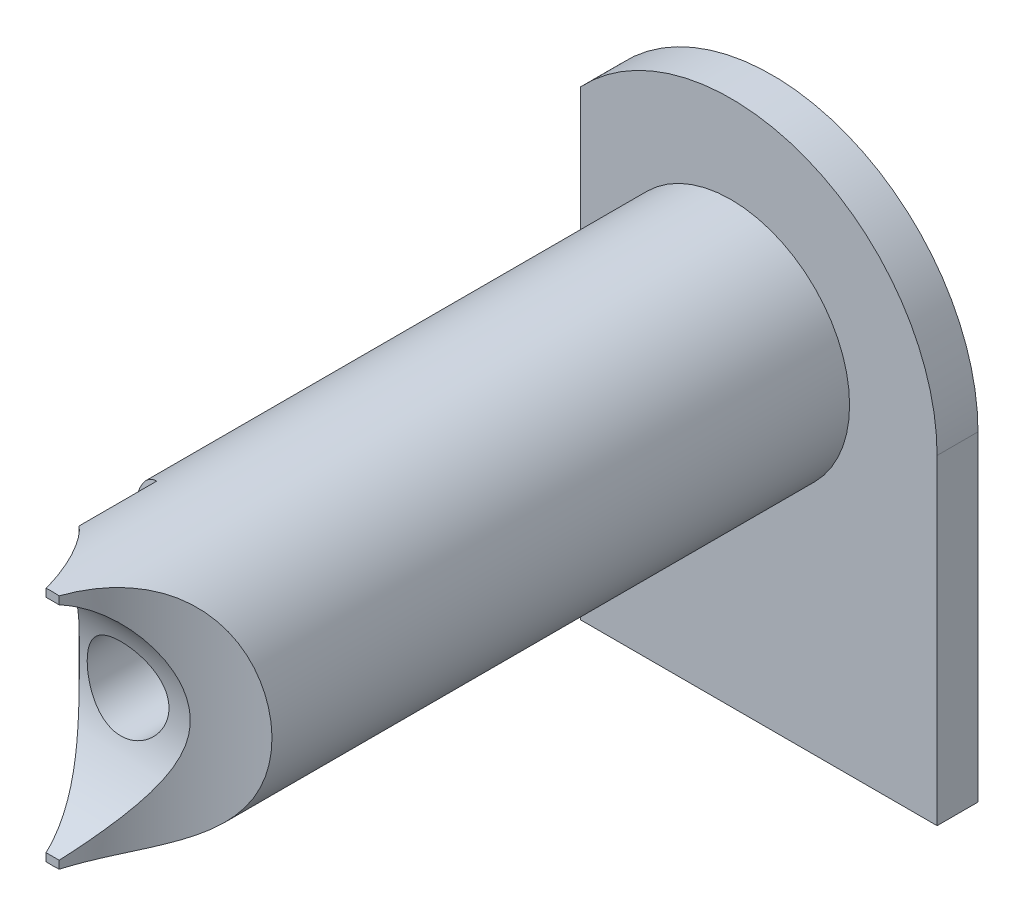
ISO-10303-21;
HEADER;
FILE_DESCRIPTION(('STEP AP214'),'2;1');
FILE_NAME('part.step','',(''),(''),'','','');
FILE_SCHEMA(('AUTOMOTIVE_DESIGN { 1 0 10303 214 1 1 1 1 }'));
ENDSEC;
DATA;
#1=APPLICATION_CONTEXT('core data for automotive mechanical design processes');
#2=APPLICATION_PROTOCOL_DEFINITION('international standard','automotive_design',2000,#1);
#3=PRODUCT_CONTEXT('',#1,'mechanical');
#4=PRODUCT('Part','Part','',(#3));
#5=PRODUCT_RELATED_PRODUCT_CATEGORY('part','',(#4));
#6=PRODUCT_DEFINITION_FORMATION('','',#4);
#7=PRODUCT_DEFINITION_CONTEXT('part definition',#1,'design');
#8=PRODUCT_DEFINITION('design','',#6,#7);
#9=PRODUCT_DEFINITION_SHAPE('','',#8);
#10=(LENGTH_UNIT() NAMED_UNIT(*) SI_UNIT(.MILLI.,.METRE.));
#11=(NAMED_UNIT(*) PLANE_ANGLE_UNIT() SI_UNIT($,.RADIAN.));
#12=(NAMED_UNIT(*) SI_UNIT($,.STERADIAN.) SOLID_ANGLE_UNIT());
#13=UNCERTAINTY_MEASURE_WITH_UNIT(LENGTH_MEASURE(1.E-05),#10,'distance_accuracy_value','');
#14=(GEOMETRIC_REPRESENTATION_CONTEXT(3) GLOBAL_UNCERTAINTY_ASSIGNED_CONTEXT((#13)) GLOBAL_UNIT_ASSIGNED_CONTEXT((#10,
#11,#12)) REPRESENTATION_CONTEXT('',''));
#15=CARTESIAN_POINT('',(0.,0.,0.));
#16=DIRECTION('',(0.,0.,1.));
#17=DIRECTION('',(1.,0.,0.));
#18=AXIS2_PLACEMENT_3D('',#15,#16,#17);
#19=CARTESIAN_POINT('',(0.,0.,0.));
#20=DIRECTION('',(0.,0.,1.));
#21=DIRECTION('',(1.,0.,0.));
#22=AXIS2_PLACEMENT_3D('',#19,#20,#21);
#23=CYLINDRICAL_SURFACE('',#22,2.2);
#24=CARTESIAN_POINT('',(0.,0.,1.39999999998963));
#25=DIRECTION('',(0.,0.,-1.));
#26=DIRECTION('',(1.,0.,0.));
#27=AXIS2_PLACEMENT_3D('',#24,#25,#26);
#28=CIRCLE('',#27,2.20000000001619);
#29=CARTESIAN_POINT('',(2.20000000001619,0.,1.39999999998963));
#30=VERTEX_POINT('',#29);
#31=EDGE_CURVE('E189',#30,#30,#28,.T.);
#32=ORIENTED_EDGE('',*,*,#31,.T.);
#33=EDGE_LOOP('',(#32));
#34=FACE_BOUND('',#33,.T.);
#35=CARTESIAN_POINT('',(0.,0.,16.));
#36=DIRECTION('',(0.,0.,1.));
#37=DIRECTION('',(1.,0.,0.));
#38=AXIS2_PLACEMENT_3D('',#35,#36,#37);
#39=CIRCLE('',#38,2.2);
#40=CARTESIAN_POINT('',(2.2,0.,16.));
#41=VERTEX_POINT('',#40);
#42=EDGE_CURVE('E19',#41,#41,#39,.T.);
#43=ORIENTED_EDGE('',*,*,#42,.T.);
#44=EDGE_LOOP('',(#43));
#45=FACE_BOUND('',#44,.T.);
#46=ADVANCED_FACE('F16',(#34,#45),#23,.F.);
#47=CARTESIAN_POINT('',(0.,0.,16.));
#48=DIRECTION('',(0.,0.,1.));
#49=DIRECTION('',(1.,0.,0.));
#50=AXIS2_PLACEMENT_3D('',#47,#48,#49);
#51=PLANE('',#50);
#52=CARTESIAN_POINT('',(0.,0.,16.));
#53=DIRECTION('',(0.,0.,-1.));
#54=DIRECTION('',(-1.,0.,0.));
#55=AXIS2_PLACEMENT_3D('',#52,#53,#54);
#56=CIRCLE('',#55,1.25);
#57=CARTESIAN_POINT('',(-1.25,0.,16.));
#58=VERTEX_POINT('',#57);
#59=EDGE_CURVE('E193',#58,#58,#56,.F.);
#60=ORIENTED_EDGE('',*,*,#59,.T.);
#61=EDGE_LOOP('',(#60));
#62=FACE_BOUND('',#61,.T.);
#63=ORIENTED_EDGE('',*,*,#42,.F.);
#64=EDGE_LOOP('',(#63));
#65=FACE_BOUND('',#64,.T.);
#66=ADVANCED_FACE('F291',(#62,#65),#51,.F.);
#67=CARTESIAN_POINT('',(0.,0.,0.));
#68=DIRECTION('',(0.,0.,-1.));
#69=DIRECTION('',(-1.,0.,0.));
#70=AXIS2_PLACEMENT_3D('',#67,#68,#69);
#71=CONICAL_SURFACE('',#70,3.60000000000582,0.785398163397448);
#72=CARTESIAN_POINT('',(0.,0.,0.));
#73=DIRECTION('',(0.,0.,-1.));
#74=DIRECTION('',(-1.,0.,0.));
#75=AXIS2_PLACEMENT_3D('',#72,#73,#74);
#76=CIRCLE('',#75,3.60000000000582);
#77=CARTESIAN_POINT('',(-3.60000000000582,0.,0.));
#78=VERTEX_POINT('',#77);
#79=EDGE_CURVE('E170',#78,#78,#76,.T.);
#80=ORIENTED_EDGE('',*,*,#79,.T.);
#81=EDGE_LOOP('',(#80));
#82=FACE_BOUND('',#81,.T.);
#83=ORIENTED_EDGE('',*,*,#31,.F.);
#84=EDGE_LOOP('',(#83));
#85=FACE_BOUND('',#84,.T.);
#86=ADVANCED_FACE('F288',(#82,#85),#71,.F.);
#87=CARTESIAN_POINT('',(0.,0.,22.));
#88=DIRECTION('',(0.,0.,-1.));
#89=DIRECTION('',(-1.,0.,0.));
#90=AXIS2_PLACEMENT_3D('',#87,#88,#89);
#91=CYLINDRICAL_SURFACE('',#90,1.25);
#92=ORIENTED_EDGE('',*,*,#59,.F.);
#93=EDGE_LOOP('',(#92));
#94=FACE_BOUND('',#93,.T.);
#95=CARTESIAN_POINT('',(0.,1.25,19.8978436713564));
#96=CARTESIAN_POINT('',(-0.0679244800988479,1.25000086796655,19.8978443860581));
#97=CARTESIAN_POINT('',(-0.135842933793422,1.24444487050265,19.8957833530326));
#98=CARTESIAN_POINT('',(-0.269657575517761,1.22244980443124,19.8878088146394));
#99=CARTESIAN_POINT('',(-0.335553550477822,1.20600959325332,19.881894904817));
#100=CARTESIAN_POINT('',(-0.463360945324166,1.16290062835713,19.8669627047752));
#101=CARTESIAN_POINT('',(-0.525280337329512,1.13625313605356,19.8579508713991));
#102=CARTESIAN_POINT('',(-0.643791152118634,1.07355949262704,19.837847899369));
#103=CARTESIAN_POINT('',(-0.700381263501824,1.03751103634852,19.8267562509232));
#104=CARTESIAN_POINT('',(-0.809007347203373,0.955414579593332,19.8032203151329));
#105=CARTESIAN_POINT('',(-0.860786737513333,0.909037171034703,19.7907405403483));
#106=CARTESIAN_POINT('',(-0.956009639956803,0.808301154152748,19.766133329688));
#107=CARTESIAN_POINT('',(-0.999451698829062,0.753941157312231,19.7540059555505));
#108=CARTESIAN_POINT('',(-1.07795080960379,0.636886846726681,19.7310560526318));
#109=CARTESIAN_POINT('',(-1.11273621101807,0.574000420441734,19.7202800833318));
#110=CARTESIAN_POINT('',(-1.17113157115788,0.442831894091509,19.701667612356));
#111=CARTESIAN_POINT('',(-1.19474477999888,0.374551369983123,19.6938302559428));
#112=CARTESIAN_POINT('',(-1.2292470985948,0.237225190263073,19.6822295733358));
#113=CARTESIAN_POINT('',(-1.24057636261075,0.16830221771519,19.678325699712));
#114=CARTESIAN_POINT('',(-1.25159174102537,0.0294302907076386,19.6745314082797));
#115=CARTESIAN_POINT('',(-1.25128107389356,-0.0405183747982762,19.6746398810475));
#116=CARTESIAN_POINT('',(-1.23929822635911,-0.176329706572923,19.6787644389511));
#117=CARTESIAN_POINT('',(-1.22810474950267,-0.242240442098288,19.6826158787156));
#118=CARTESIAN_POINT('',(-1.19546944676986,-0.371182833738493,19.6935843230476));
#119=CARTESIAN_POINT('',(-1.17402691447761,-0.434214291071031,19.7007015527082));
#120=CARTESIAN_POINT('',(-1.12123918718876,-0.556620898055839,19.7176047832685));
#121=CARTESIAN_POINT('',(-1.08976314845211,-0.61593458665218,19.7274257985207));
#122=CARTESIAN_POINT('',(-1.01791174395466,-0.728575193755699,19.7487221659081));
#123=CARTESIAN_POINT('',(-0.977533779711246,-0.781900357331002,19.760198000748));
#124=CARTESIAN_POINT('',(-0.886641267506775,-0.883891513879295,19.7842833845292));
#125=CARTESIAN_POINT('',(-0.8357188282652,-0.932187934326669,19.7969209237661));
#126=CARTESIAN_POINT('',(-0.726397770707999,-1.01968084494647,19.8214254442492));
#127=CARTESIAN_POINT('',(-0.66799781853852,-1.05887570804644,19.8332922874464));
#128=CARTESIAN_POINT('',(-0.544129319151011,-1.12761669610327,19.8550717885169));
#129=CARTESIAN_POINT('',(-0.478561028872439,-1.15699504567843,19.8649494215703));
#130=CARTESIAN_POINT('',(-0.342979508718129,-1.20416381175255,19.8812278361306));
#131=CARTESIAN_POINT('',(-0.272968324636218,-1.22195951975829,19.8876302050829));
#132=CARTESIAN_POINT('',(-0.134090244649073,-1.24468095728118,19.8958697798906));
#133=CARTESIAN_POINT('',(-0.065329920620134,-1.25018382842495,19.897911498419));
#134=CARTESIAN_POINT('',(0.0721472888909036,-1.24980687642328,19.8977724226291));
#135=CARTESIAN_POINT('',(0.140864180299875,-1.24392932217262,19.8955924699776));
#136=CARTESIAN_POINT('',(0.273588572060938,-1.22147843143933,19.8874606833778));
#137=CARTESIAN_POINT('',(0.337675880725648,-1.20531827758905,19.8816547123743));
#138=CARTESIAN_POINT('',(0.462212228709352,-1.16326336828004,19.8670890804522));
#139=CARTESIAN_POINT('',(0.522660591188891,-1.13736680831216,19.8583288720372));
#140=CARTESIAN_POINT('',(0.640446216933245,-1.07559215860392,19.838479568612));
#141=CARTESIAN_POINT('',(0.69761176173089,-1.03940914354079,19.8273223701759));
#142=CARTESIAN_POINT('',(0.80526753647923,-0.958428141299509,19.8040632405038));
#143=CARTESIAN_POINT('',(0.855755651824465,-0.913627436046384,19.7919610119165));
#144=CARTESIAN_POINT('',(0.951354636496911,-0.813903923966883,19.7674102209685));
#145=CARTESIAN_POINT('',(0.996046346298425,-0.758574360910484,19.7549766337844));
#146=CARTESIAN_POINT('',(1.07554433194323,-0.640894131740424,19.7317831377029));
#147=CARTESIAN_POINT('',(1.11035087446422,-0.578543655097271,19.7210231836585));
#148=CARTESIAN_POINT('',(1.16878954928363,-0.448840953661153,19.7024299594336));
#149=CARTESIAN_POINT('',(1.19248711414304,-0.381520791166974,19.6945796103623));
#150=CARTESIAN_POINT('',(1.22811609579468,-0.243523290194956,19.6826186057761));
#151=CARTESIAN_POINT('',(1.24005211170052,-0.172847275295524,19.6785064885507));
#152=CARTESIAN_POINT('',(1.25138151325684,-0.0339646408415084,19.6746036325415));
#153=CARTESIAN_POINT('',(1.25137467368776,0.0341877486817581,19.674606249536));
#154=CARTESIAN_POINT('',(1.24031579157669,0.169475270760439,19.6784153912838));
#155=CARTESIAN_POINT('',(1.22926475952144,0.236610495810688,19.6822215680309));
#156=CARTESIAN_POINT('',(1.19683703997043,0.366739710113705,19.6931287184379));
#157=CARTESIAN_POINT('',(1.17565097385536,0.429786678559307,19.7001687752202));
#158=CARTESIAN_POINT('',(1.12373438064327,0.551450801547351,19.7168175975318));
#159=CARTESIAN_POINT('',(1.09300209006457,0.610067135125508,19.7264268376227));
#160=CARTESIAN_POINT('',(1.02150459005946,0.72367495976101,19.7476932825457));
#161=CARTESIAN_POINT('',(0.980398025175527,0.7784393292172,19.7594152000636));
#162=CARTESIAN_POINT('',(0.889887080709123,0.880486113485907,19.7834460652259));
#163=CARTESIAN_POINT('',(0.840479956379136,0.92776604334017,19.7957552060804));
#164=CARTESIAN_POINT('',(0.732239723477382,1.01557160693506,19.8202070041386));
#165=CARTESIAN_POINT('',(0.673093154621859,1.05572043580642,19.8323198618095));
#166=CARTESIAN_POINT('',(0.548510903251562,1.1254910455994,19.8543727114239));
#167=CARTESIAN_POINT('',(0.483076273882375,1.15511458544152,19.8643130663155));
#168=CARTESIAN_POINT('',(0.349091955921276,1.20232010017759,19.8805798993618));
#169=CARTESIAN_POINT('',(0.280634096711385,1.22013735783424,19.8869765451443));
#170=CARTESIAN_POINT('',(0.141448006087147,1.24397438925929,19.8956071887561));
#171=CARTESIAN_POINT('',(0.0707207366450371,1.24999909630175,19.8978429272324));
#172=CARTESIAN_POINT('',(0.,1.25,19.8978436713564));
#173=B_SPLINE_CURVE_WITH_KNOTS('',3,(#95,#96,#97,#98,#99,#100,#101,#102,#103,#104,#105,#106,
#107,#108,#109,#110,#111,#112,#113,#114,#115,#116,#117,#118,#119,#120,#121,#122,#123,#124,#125,
#126,#127,#128,#129,#130,#131,#132,#133,#134,#135,#136,#137,#138,#139,#140,#141,#142,#143,#144,
#145,#146,#147,#148,#149,#150,#151,#152,#153,#154,#155,#156,#157,#158,#159,#160,#161,#162,#163,
#164,#165,#166,#167,#168,#169,#170,#171,#172),.UNSPECIFIED.,.T.,.F.,(4,2,2,2,2,2,2,2,2,2,2,2,2,
2,2,2,2,2,2,2,2,2,2,2,2,2,2,2,2,2,2,2,2,2,2,2,2,2,4),(0.,0.203511139491736,0.407043645954993,
0.610154486559866,0.813315177694251,1.02423741599598,1.23519638634716,1.45211698254992,
1.66897443527126,1.87777478156237,2.08651739447182,2.28647500077357,2.48644639113581,
2.68914025789089,2.89189336974925,3.1048510057456,3.31784668261728,3.53431589010938,
3.75068613453101,3.95666316344897,4.16259913132811,4.36074177300059,4.55892115580724,
4.7637300924964,4.96860373347955,5.18418899640245,5.3997684428082,5.61406164396909,
5.8282710168564,6.03172303865505,6.23515644734529,6.43490568970265,6.63469185386391,
6.84218649561138,7.04974988518443,7.26621834146235,7.4826506058514,7.69462841418539,
7.90651752514187),.UNSPECIFIED.);
#174=CARTESIAN_POINT('',(0.,1.25,19.8978436713564));
#175=VERTEX_POINT('',#174);
#176=EDGE_CURVE('E169',#175,#175,#173,.T.);
#177=ORIENTED_EDGE('',*,*,#176,.T.);
#178=EDGE_LOOP('',(#177));
#179=FACE_BOUND('',#178,.T.);
#180=ADVANCED_FACE('F284',(#94,#179),#91,.F.);
#181=CARTESIAN_POINT('',(0.,0.,0.));
#182=DIRECTION('',(0.,0.,1.));
#183=DIRECTION('',(1.,0.,0.));
#184=AXIS2_PLACEMENT_3D('',#181,#182,#183);
#185=PLANE('',#184);
#186=ORIENTED_EDGE('',*,*,#79,.F.);
#187=EDGE_LOOP('',(#186));
#188=FACE_BOUND('',#187,.T.);
#189=DIRECTION('',(0.,1.,0.));
#190=VECTOR('',#189,1.);
#191=CARTESIAN_POINT('',(6.3,-9.8,0.));
#192=LINE('',#191,#190);
#193=CARTESIAN_POINT('',(6.3,-9.8,0.));
#194=VERTEX_POINT('',#193);
#195=CARTESIAN_POINT('',(6.3,0.,0.));
#196=VERTEX_POINT('',#195);
#197=EDGE_CURVE('E110',#194,#196,#192,.T.);
#198=ORIENTED_EDGE('',*,*,#197,.F.);
#199=DIRECTION('',(1.,0.,0.));
#200=VECTOR('',#199,1.);
#201=CARTESIAN_POINT('',(-4.6,-9.8,0.));
#202=LINE('',#201,#200);
#203=CARTESIAN_POINT('',(-4.6,-9.8,0.));
#204=VERTEX_POINT('',#203);
#205=EDGE_CURVE('E127',#204,#194,#202,.T.);
#206=ORIENTED_EDGE('',*,*,#205,.F.);
#207=DIRECTION('',(0.,-1.,0.));
#208=VECTOR('',#207,1.);
#209=CARTESIAN_POINT('',(-4.6,4.30464865000618,0.));
#210=LINE('',#209,#208);
#211=CARTESIAN_POINT('',(-4.6,4.30464865000618,0.));
#212=VERTEX_POINT('',#211);
#213=EDGE_CURVE('E165',#212,#204,#210,.T.);
#214=ORIENTED_EDGE('',*,*,#213,.F.);
#215=CARTESIAN_POINT('',(0.,0.,0.));
#216=DIRECTION('',(0.,0.,1.));
#217=DIRECTION('',(1.,0.,0.));
#218=AXIS2_PLACEMENT_3D('',#215,#216,#217);
#219=CIRCLE('',#218,6.3);
#220=EDGE_CURVE('E103',#196,#212,#219,.T.);
#221=ORIENTED_EDGE('',*,*,#220,.F.);
#222=EDGE_LOOP('',(#198,#206,#214,#221));
#223=FACE_BOUND('',#222,.T.);
#224=ADVANCED_FACE('F272',(#188,#223),#185,.F.);
#225=CARTESIAN_POINT('',(0.,0.,23.2935034352874));
#226=DIRECTION('',(1.,0.,0.));
#227=DIRECTION('',(0.,0.,-1.));
#228=AXIS2_PLACEMENT_3D('',#225,#226,#227);
#229=CYLINDRICAL_SURFACE('',#228,3.61842579478704);
#230=ORIENTED_EDGE('',*,*,#176,.F.);
#231=EDGE_LOOP('',(#230));
#232=FACE_BOUND('',#231,.T.);
#233=DIRECTION('',(1.,0.,0.));
#234=VECTOR('',#233,1.);
#235=CARTESIAN_POINT('',(0.,3.37932746197818,22.));
#236=LINE('',#235,#234);
#237=CARTESIAN_POINT('',(-0.184638075837882,3.37932746197818,22.));
#238=VERTEX_POINT('',#237);
#239=CARTESIAN_POINT('',(0.218219539958672,3.37932746197818,22.));
#240=VERTEX_POINT('',#239);
#241=EDGE_CURVE('E171',#238,#240,#236,.T.);
#242=ORIENTED_EDGE('',*,*,#241,.F.);
#243=CARTESIAN_POINT('',(-0.184638075837882,3.37932746197818,22.));
#244=CARTESIAN_POINT('',(-0.211156231165822,3.34149870850248,21.9011564537886));
#245=CARTESIAN_POINT('',(-0.240102435210036,3.29956334294519,21.804599611213));
#246=CARTESIAN_POINT('',(-0.302028706600854,3.2081121569774,21.6166244880252));
#247=CARTESIAN_POINT('',(-0.335004563774821,3.15860423496916,21.5252009874701));
#248=CARTESIAN_POINT('',(-0.404101696405193,3.05275051746999,21.3481697718626));
#249=CARTESIAN_POINT('',(-0.440211237197433,2.99642994547444,21.2625423295464));
#250=CARTESIAN_POINT('',(-0.514855657187254,2.877318330208,21.0970419071478));
#251=CARTESIAN_POINT('',(-0.553391169868868,2.81452559413697,21.0171704418753));
#252=CARTESIAN_POINT('',(-0.671071326812881,2.61764283811563,20.7871974398669));
#253=CARTESIAN_POINT('',(-0.752632892515098,2.47453761652903,20.6458931668224));
#254=CARTESIAN_POINT('',(-0.91514122800787,2.16661334121827,20.3884801926924));
#255=CARTESIAN_POINT('',(-0.996087029222736,2.00176549151058,20.2724054551357));
#256=CARTESIAN_POINT('',(-1.13854217466289,1.67541983500405,20.0815381400047));
#257=CARTESIAN_POINT('',(-1.2012012753984,1.51645563765253,20.0032924300049));
#258=CARTESIAN_POINT('',(-1.31272831562854,1.18472090812666,19.8698730102282));
#259=CARTESIAN_POINT('',(-1.36162706865452,1.0119823531467,19.8146476153272));
#260=CARTESIAN_POINT('',(-1.43108421837339,0.688496535683084,19.7380477448507));
#261=CARTESIAN_POINT('',(-1.45520583678599,0.539567696935899,19.7123090323962));
#262=CARTESIAN_POINT('',(-1.48590572805914,0.237910065879286,19.6797308912269));
#263=CARTESIAN_POINT('',(-1.49250140019073,0.0851851943634162,19.6728727181946));
#264=CARTESIAN_POINT('',(-1.48711347849168,-0.219638538059778,19.6785316728409));
#265=CARTESIAN_POINT('',(-1.47511992170577,-0.371737019438807,19.6910591903351));
#266=CARTESIAN_POINT('',(-1.43442357218647,-0.67100977546266,19.7346139908888));
#267=CARTESIAN_POINT('',(-1.4056997864648,-0.81817761737474,19.7656645176927));
#268=CARTESIAN_POINT('',(-1.32503908738958,-1.14628720981243,19.8560875352559));
#269=CARTESIAN_POINT('',(-1.26877988168136,-1.32459779253885,19.9210717458046));
#270=CARTESIAN_POINT('',(-1.14340801119706,-1.66541071910351,20.075649049543));
#271=CARTESIAN_POINT('',(-1.07426888421057,-1.82787944915997,20.1652929910027));
#272=CARTESIAN_POINT('',(-0.929036379858701,-2.13918185944321,20.3690728991352));
#273=CARTESIAN_POINT('',(-0.852820661460019,-2.28762171998165,20.4837192110942));
#274=CARTESIAN_POINT('',(-0.701382057343645,-2.5651243495847,20.7345935165106));
#275=CARTESIAN_POINT('',(-0.626157563676736,-2.69422331116887,20.8707801939833));
#276=CARTESIAN_POINT('',(-0.518621597069257,-2.87119991529148,21.0894426414053));
#277=CARTESIAN_POINT('',(-0.483831102446247,-2.92715907171335,21.1642913146299));
#278=CARTESIAN_POINT('',(-0.416464846072824,-3.03352434479586,21.3187815726451));
#279=CARTESIAN_POINT('',(-0.383888590896951,-3.08393170019425,21.3984220821068));
#280=CARTESIAN_POINT('',(-0.321456204380259,-3.17898141683488,21.5625759173482));
#281=CARTESIAN_POINT('',(-0.291611547947464,-3.2235997601302,21.6471075640776));
#282=CARTESIAN_POINT('',(-0.235373748885312,-3.30641251909317,21.82045054339));
#283=CARTESIAN_POINT('',(-0.208983543288508,-3.34460147618006,21.9092654309972));
#284=CARTESIAN_POINT('',(-0.184638075837881,-3.37932746197819,22.));
#285=B_SPLINE_CURVE_WITH_KNOTS('',3,(#243,#244,#245,#246,#247,#248,#249,#250,#251,#252,#253,
#254,#255,#256,#257,#258,#259,#260,#261,#262,#263,#264,#265,#266,#267,#268,#269,#270,#271,#272,
#273,#274,#275,#276,#277,#278,#279,#280,#281,#282,#283,#284),.UNSPECIFIED.,.F.,.F.,(4,2,2,2,2,2,
2,2,2,2,2,2,2,2,2,2,2,2,2,2,4),(0.,0.327108060363067,0.653877234984881,0.979471606352299,
1.3051513543538,1.95341331613028,2.60254262412977,3.16433156329025,3.72485229241627,
4.182013982662,4.63872164565754,5.09567416720481,5.55320130900164,6.14384287358508,
6.73571158795343,7.34103221298297,7.94520556295312,8.24412659479571,8.54298079460886,
8.84303774768608,9.14334817979042),.UNSPECIFIED.);
#286=CARTESIAN_POINT('',(-0.184638075837881,-3.37932746197818,22.));
#287=VERTEX_POINT('',#286);
#288=EDGE_CURVE('E175',#238,#287,#285,.T.);
#289=ORIENTED_EDGE('',*,*,#288,.T.);
#290=DIRECTION('',(1.,0.,0.));
#291=VECTOR('',#290,1.);
#292=CARTESIAN_POINT('',(0.,-3.37932746197818,22.));
#293=LINE('',#292,#291);
#294=CARTESIAN_POINT('',(0.218219539958672,-3.37932746197818,22.));
#295=VERTEX_POINT('',#294);
#296=EDGE_CURVE('E166',#295,#287,#293,.F.);
#297=ORIENTED_EDGE('',*,*,#296,.F.);
#298=CARTESIAN_POINT('',(0.218219539958672,-3.37932746197818,22.));
#299=CARTESIAN_POINT('',(0.249955595366505,-3.34129490718428,21.9006260992964));
#300=CARTESIAN_POINT('',(0.284622608844999,-3.29921371335805,21.8038249336452));
#301=CARTESIAN_POINT('',(0.358874569765495,-3.20773227207749,21.6158999905739));
#302=CARTESIAN_POINT('',(0.398452521957451,-3.15834241634905,21.5247684090622));
#303=CARTESIAN_POINT('',(0.481412109280792,-3.05324603464561,21.3489932261304));
#304=CARTESIAN_POINT('',(0.524767948097167,-2.99758168690944,21.2643120424699));
#305=CARTESIAN_POINT('',(0.614630027769926,-2.88026548643591,21.1009731962136));
#306=CARTESIAN_POINT('',(0.661137389969564,-2.81861149910588,21.0223176990502));
#307=CARTESIAN_POINT('',(0.803537182970882,-2.62617949665099,20.7964695843413));
#308=CARTESIAN_POINT('',(0.902861324595828,-2.4872440652626,20.6582654552818));
#309=CARTESIAN_POINT('',(1.10382943480736,-2.18967908156275,20.4062047350761));
#310=CARTESIAN_POINT('',(1.20547857075844,-2.03100128134004,20.2924097196792));
#311=CARTESIAN_POINT('',(1.38744824926844,-1.71969183503718,20.1054786092747));
#312=CARTESIAN_POINT('',(1.46868125810829,-1.56972223376261,20.0288042654267));
#313=CARTESIAN_POINT('',(1.61859507468528,-1.25534052987597,19.8955423392714));
#314=CARTESIAN_POINT('',(1.68730843145521,-1.09096757227611,19.8389022990206));
#315=CARTESIAN_POINT('',(1.78407116856308,-0.799205821324052,19.7622552275132));
#316=CARTESIAN_POINT('',(1.81813629235307,-0.675412440235208,19.7363604986931));
#317=CARTESIAN_POINT('',(1.8699638889713,-0.422557817866898,19.69757133253));
#318=CARTESIAN_POINT('',(1.88776080128269,-0.293508311929657,19.6846494262472));
#319=CARTESIAN_POINT('',(1.9039713158961,-0.0327035544222784,19.6728618199396));
#320=CARTESIAN_POINT('',(1.90226877130446,0.0990632387624701,19.6740803467978));
#321=CARTESIAN_POINT('',(1.87953775332483,0.360062829307596,19.6906537282976));
#322=CARTESIAN_POINT('',(1.85848336601226,0.489291991489006,19.7060275382334));
#323=CARTESIAN_POINT('',(1.79340159777166,0.773832864086648,19.7551384332685));
#324=CARTESIAN_POINT('',(1.74490124501591,0.927444496541583,19.7925446470255));
#325=CARTESIAN_POINT('',(1.63224816655548,1.22347710666229,19.8846461611147));
#326=CARTESIAN_POINT('',(1.56804631713182,1.3658610718166,19.9393958842611));
#327=CARTESIAN_POINT('',(1.44859049514985,1.60457570668872,20.0483690565294));
#328=CARTESIAN_POINT('',(1.39519091495397,1.70343437789258,20.0992111252219));
#329=CARTESIAN_POINT('',(1.28581693924228,1.89508020958081,20.209044778376));
#330=CARTESIAN_POINT('',(1.22984131203267,1.98786441320282,20.2680402888479));
#331=CARTESIAN_POINT('',(1.11706053040588,2.16741089926434,20.3939595772521));
#332=CARTESIAN_POINT('',(1.06025509651569,2.25417109349274,20.4608860829024));
#333=CARTESIAN_POINT('',(0.947277450181522,2.42150527115037,20.6025285263854));
#334=CARTESIAN_POINT('',(0.891105375481016,2.50207793023455,20.6772461237552));
#335=CARTESIAN_POINT('',(0.738883420718191,2.71528114483798,20.8939750580893));
#336=CARTESIAN_POINT('',(0.644761687038023,2.84126157853707,21.0441856505552));
#337=CARTESIAN_POINT('',(0.513224865558886,3.01244722593785,21.2865363692757));
#338=CARTESIAN_POINT('',(0.471037092150247,3.06648426251062,21.3700355919397));
#339=CARTESIAN_POINT('',(0.390589747786621,3.16818347863871,21.5426088703919));
#340=CARTESIAN_POINT('',(0.352327503413965,3.21585000351376,21.6316790647196));
#341=CARTESIAN_POINT('',(0.298874623312115,3.28162373663356,21.7682373781404));
#342=CARTESIAN_POINT('',(0.281872812231806,3.30240414888444,21.8137549004021));
#343=CARTESIAN_POINT('',(0.249100289691648,3.34220484205815,21.9059898113939));
#344=CARTESIAN_POINT('',(0.233329651090148,3.36122501882607,21.9527072709168));
#345=CARTESIAN_POINT('',(0.218219539958636,3.37932746197831,21.9999999999999));
#346=B_SPLINE_CURVE_WITH_KNOTS('',3,(#298,#299,#300,#301,#302,#303,#304,#305,#306,#307,#308,
#309,#310,#311,#312,#313,#314,#315,#316,#317,#318,#319,#320,#321,#322,#323,#324,#325,#326,#327,
#328,#329,#330,#331,#332,#333,#334,#335,#336,#337,#338,#339,#340,#341,#342,#343,#344,#345),
.UNSPECIFIED.,.F.,.F.,(4,2,2,2,2,2,2,2,2,2,2,2,2,2,2,2,2,2,2,2,2,2,2,4),(0.,0.332850360488146,
0.665231930102698,0.995499245862366,1.32588469737193,1.98240202844311,2.64055653949701,
3.20000818888788,3.75798392959356,4.14950264865803,4.54019059773311,4.93320685141966,
5.32675015852905,5.82013096474709,6.31507556536427,6.6846162396128,7.0543354775105,
7.42418224452947,7.79410795210199,8.44346251961739,8.76727141479949,9.09085830055256,
9.24934826830561,9.4078476080825),.UNSPECIFIED.);
#347=EDGE_CURVE('E260',#295,#240,#346,.T.);
#348=ORIENTED_EDGE('',*,*,#347,.T.);
#349=EDGE_LOOP('',(#242,#289,#297,#348));
#350=FACE_BOUND('',#349,.T.);
#351=ADVANCED_FACE('F266',(#232,#350),#229,.F.);
#352=CARTESIAN_POINT('',(0.,0.,0.));
#353=DIRECTION('',(0.,0.,1.));
#354=DIRECTION('',(1.,0.,0.));
#355=AXIS2_PLACEMENT_3D('',#352,#353,#354);
#356=CYLINDRICAL_SURFACE('',#355,6.3);
#357=CARTESIAN_POINT('',(0.,0.,1.25));
#358=DIRECTION('',(0.,0.,1.));
#359=DIRECTION('',(1.,0.,0.));
#360=AXIS2_PLACEMENT_3D('',#357,#358,#359);
#361=CIRCLE('',#360,6.3);
#362=CARTESIAN_POINT('',(6.3,0.,1.25));
#363=VERTEX_POINT('',#362);
#364=CARTESIAN_POINT('',(-4.6,4.30464865000618,1.25));
#365=VERTEX_POINT('',#364);
#366=EDGE_CURVE('E149',#363,#365,#361,.T.);
#367=ORIENTED_EDGE('',*,*,#366,.F.);
#368=DIRECTION('',(0.,0.,1.));
#369=VECTOR('',#368,1.);
#370=CARTESIAN_POINT('',(6.3,0.,0.));
#371=LINE('',#370,#369);
#372=EDGE_CURVE('E131',#196,#363,#371,.T.);
#373=ORIENTED_EDGE('',*,*,#372,.F.);
#374=ORIENTED_EDGE('',*,*,#220,.T.);
#375=DIRECTION('',(0.,0.,1.));
#376=VECTOR('',#375,1.);
#377=CARTESIAN_POINT('',(-4.6,4.30464865000618,0.));
#378=LINE('',#377,#376);
#379=EDGE_CURVE('E161',#365,#212,#378,.F.);
#380=ORIENTED_EDGE('',*,*,#379,.F.);
#381=EDGE_LOOP('',(#367,#373,#374,#380));
#382=FACE_BOUND('',#381,.T.);
#383=ADVANCED_FACE('F271',(#382),#356,.T.);
#384=CARTESIAN_POINT('',(-4.6,4.30464865000618,0.));
#385=DIRECTION('',(-1.,0.,0.));
#386=DIRECTION('',(0.,-1.,0.));
#387=AXIS2_PLACEMENT_3D('',#384,#385,#386);
#388=PLANE('',#387);
#389=DIRECTION('',(0.,1.,0.));
#390=VECTOR('',#389,1.);
#391=CARTESIAN_POINT('',(-4.6,-3.08264576191558,1.25));
#392=LINE('',#391,#390);
#393=CARTESIAN_POINT('',(-4.6,-9.8,1.25));
#394=VERTEX_POINT('',#393);
#395=EDGE_CURVE('E144',#365,#394,#392,.F.);
#396=ORIENTED_EDGE('',*,*,#395,.F.);
#397=ORIENTED_EDGE('',*,*,#379,.T.);
#398=ORIENTED_EDGE('',*,*,#213,.T.);
#399=DIRECTION('',(0.,0.,1.));
#400=VECTOR('',#399,1.);
#401=CARTESIAN_POINT('',(-4.6,-9.8,0.));
#402=LINE('',#401,#400);
#403=EDGE_CURVE('E156',#394,#204,#402,.F.);
#404=ORIENTED_EDGE('',*,*,#403,.F.);
#405=EDGE_LOOP('',(#396,#397,#398,#404));
#406=FACE_BOUND('',#405,.T.);
#407=ADVANCED_FACE('F375',(#406),#388,.T.);
#408=CARTESIAN_POINT('',(-4.6,-9.8,0.));
#409=DIRECTION('',(0.,-1.,0.));
#410=DIRECTION('',(1.,0.,0.));
#411=AXIS2_PLACEMENT_3D('',#408,#409,#410);
#412=PLANE('',#411);
#413=DIRECTION('',(1.,0.,0.));
#414=VECTOR('',#413,1.);
#415=CARTESIAN_POINT('',(0.574107153339075,-9.8,1.25));
#416=LINE('',#415,#414);
#417=CARTESIAN_POINT('',(6.3,-9.8,1.25));
#418=VERTEX_POINT('',#417);
#419=EDGE_CURVE('E125',#394,#418,#416,.T.);
#420=ORIENTED_EDGE('',*,*,#419,.F.);
#421=ORIENTED_EDGE('',*,*,#403,.T.);
#422=ORIENTED_EDGE('',*,*,#205,.T.);
#423=DIRECTION('',(0.,0.,1.));
#424=VECTOR('',#423,1.);
#425=CARTESIAN_POINT('',(6.3,-9.8,0.));
#426=LINE('',#425,#424);
#427=EDGE_CURVE('E120',#418,#194,#426,.F.);
#428=ORIENTED_EDGE('',*,*,#427,.F.);
#429=EDGE_LOOP('',(#420,#421,#422,#428));
#430=FACE_BOUND('',#429,.T.);
#431=ADVANCED_FACE('F122',(#430),#412,.T.);
#432=CARTESIAN_POINT('',(6.3,-9.8,0.));
#433=DIRECTION('',(1.,0.,0.));
#434=DIRECTION('',(0.,1.,0.));
#435=AXIS2_PLACEMENT_3D('',#432,#433,#434);
#436=PLANE('',#435);
#437=DIRECTION('',(0.,1.,0.));
#438=VECTOR('',#437,1.);
#439=CARTESIAN_POINT('',(6.3,-3.08264576191558,1.25));
#440=LINE('',#439,#438);
#441=EDGE_CURVE('E135',#418,#363,#440,.T.);
#442=ORIENTED_EDGE('',*,*,#441,.F.);
#443=ORIENTED_EDGE('',*,*,#427,.T.);
#444=ORIENTED_EDGE('',*,*,#197,.T.);
#445=ORIENTED_EDGE('',*,*,#372,.T.);
#446=EDGE_LOOP('',(#442,#443,#444,#445));
#447=FACE_BOUND('',#446,.T.);
#448=ADVANCED_FACE('F136',(#447),#436,.T.);
#449=CARTESIAN_POINT('',(-1.8,0.,17.));
#450=DIRECTION('',(0.5,0.,-0.866025403784439));
#451=DIRECTION('',(-0.866025403784439,0.,-0.5));
#452=AXIS2_PLACEMENT_3D('',#449,#450,#451);
#453=PLANE('',#452);
#454=DIRECTION('',(0.,1.,0.));
#455=VECTOR('',#454,1.);
#456=CARTESIAN_POINT('',(-1.8,0.,17.));
#457=LINE('',#456,#455);
#458=CARTESIAN_POINT('',(-1.8,-3.14652586196268,17.));
#459=VERTEX_POINT('',#458);
#460=CARTESIAN_POINT('',(-1.8,3.14652586196268,17.));
#461=VERTEX_POINT('',#460);
#462=EDGE_CURVE('E130',#459,#461,#457,.T.);
#463=ORIENTED_EDGE('',*,*,#462,.T.);
#464=CARTESIAN_POINT('',(0.,0.,18.0392304845413));
#465=DIRECTION('',(0.5,0.,-0.866025403784439));
#466=DIRECTION('',(0.866025403784439,0.,0.5));
#467=AXIS2_PLACEMENT_3D('',#464,#465,#466);
#468=ELLIPSE('',#467,4.18578945162479,3.625);
#469=EDGE_CURVE('E238',#459,#461,#468,.T.);
#470=ORIENTED_EDGE('',*,*,#469,.F.);
#471=EDGE_LOOP('',(#463,#470));
#472=FACE_BOUND('',#471,.T.);
#473=ADVANCED_FACE('F366',(#472),#453,.F.);
#474=CARTESIAN_POINT('',(-1.8,0.,22.));
#475=DIRECTION('',(1.,0.,0.));
#476=DIRECTION('',(0.,0.,-1.));
#477=AXIS2_PLACEMENT_3D('',#474,#475,#476);
#478=PLANE('',#477);
#479=DIRECTION('',(0.,0.,1.));
#480=VECTOR('',#479,1.);
#481=CARTESIAN_POINT('',(-1.8,3.14652586196268,0.));
#482=LINE('',#481,#480);
#483=CARTESIAN_POINT('',(-1.79999999999999,3.14652586196269,19.3750776405004));
#484=VERTEX_POINT('',#483);
#485=EDGE_CURVE('E328',#461,#484,#482,.T.);
#486=ORIENTED_EDGE('',*,*,#485,.F.);
#487=ORIENTED_EDGE('',*,*,#462,.F.);
#488=DIRECTION('',(0.,0.,1.));
#489=VECTOR('',#488,1.);
#490=CARTESIAN_POINT('',(-1.8,-3.14652586196268,0.));
#491=LINE('',#490,#489);
#492=CARTESIAN_POINT('',(-1.8,-3.14652586196268,19.3750776405004));
#493=VERTEX_POINT('',#492);
#494=EDGE_CURVE('E237',#493,#459,#491,.F.);
#495=ORIENTED_EDGE('',*,*,#494,.F.);
#496=DIRECTION('',(0.,1.,0.));
#497=VECTOR('',#496,1.);
#498=CARTESIAN_POINT('',(-1.79999999999999,0.,19.3750776405004));
#499=LINE('',#498,#497);
#500=EDGE_CURVE('E259',#493,#484,#499,.T.);
#501=ORIENTED_EDGE('',*,*,#500,.T.);
#502=EDGE_LOOP('',(#486,#487,#495,#501));
#503=FACE_BOUND('',#502,.T.);
#504=ADVANCED_FACE('F245',(#503),#478,.F.);
#505=CARTESIAN_POINT('',(-5.4,0.,23.4));
#506=DIRECTION('',(0.,1.,0.));
#507=DIRECTION('',(0.,0.,1.));
#508=AXIS2_PLACEMENT_3D('',#505,#506,#507);
#509=CYLINDRICAL_SURFACE('',#508,5.4);
#510=DIRECTION('',(0.,1.,0.));
#511=VECTOR('',#510,1.);
#512=CARTESIAN_POINT('',(-0.184638075837881,0.,22.));
#513=LINE('',#512,#511);
#514=CARTESIAN_POINT('',(-0.184638075837881,3.62029470912948,22.));
#515=VERTEX_POINT('',#514);
#516=EDGE_CURVE('E174',#515,#238,#513,.F.);
#517=ORIENTED_EDGE('',*,*,#516,.F.);
#518=CARTESIAN_POINT('',(-1.79999999999999,3.14652586196269,19.3750776405004));
#519=CARTESIAN_POINT('',(-1.71977721871926,3.19242463934373,19.4467729888297));
#520=CARTESIAN_POINT('',(-1.64036903943807,3.23377401589615,19.5221673969035));
#521=CARTESIAN_POINT('',(-1.48454971683947,3.30819685108098,19.6796006841654));
#522=CARTESIAN_POINT('',(-1.40813441050172,3.34128217650513,19.7616298093544));
#523=CARTESIAN_POINT('',(-1.25990098807927,3.39994080184454,19.931250397919));
#524=CARTESIAN_POINT('',(-1.18805680222206,3.42556038862744,20.0188033076942));
#525=CARTESIAN_POINT('',(-1.04931897795177,3.47057255990351,20.1992922210633));
#526=CARTESIAN_POINT('',(-0.98242688432158,3.48996320755339,20.2922298884256));
#527=CARTESIAN_POINT('',(-0.8546555516464,3.52342600211264,20.4823150131274));
#528=CARTESIAN_POINT('',(-0.793745926306146,3.53752617552029,20.5794371580583));
#529=CARTESIAN_POINT('',(-0.678022567689542,3.56151583691171,20.7777605312194));
#530=CARTESIAN_POINT('',(-0.623211483306292,3.57140350043168,20.8789635061526));
#531=CARTESIAN_POINT('',(-0.468513246336572,3.59612305268534,21.1879067885231));
#532=CARTESIAN_POINT('',(-0.378308769641544,3.60602353140226,21.4010591801451));
#533=CARTESIAN_POINT('',(-0.280230709335227,3.61421678180914,21.6817385059798));
#534=CARTESIAN_POINT('',(-0.259448652463061,3.61575619668838,21.7449543539739));
#535=CARTESIAN_POINT('',(-0.2202692021038,3.61835541177585,21.8720004816896));
#536=CARTESIAN_POINT('',(-0.201867397620007,3.61941610848206,21.9358293823759));
#537=CARTESIAN_POINT('',(-0.184638075837881,3.62029470912948,22.));
#538=B_SPLINE_CURVE_WITH_KNOTS('',3,(#518,#519,#520,#521,#522,#523,#524,#525,#526,#527,#528,
#529,#530,#531,#532,#533,#534,#535,#536,#537),.UNSPECIFIED.,.F.,.F.,(4,2,2,2,2,2,2,2,2,4),(0.,
0.350661379517194,0.700816292854721,1.04875169253755,1.39679517571378,1.74296794119285,
2.0892904841724,2.78165454430928,2.98131823544443,3.18060644789511),.UNSPECIFIED.);
#539=EDGE_CURVE('E222',#484,#515,#538,.T.);
#540=ORIENTED_EDGE('',*,*,#539,.F.);
#541=ORIENTED_EDGE('',*,*,#500,.F.);
#542=CARTESIAN_POINT('',(-0.184638075837882,-3.62029470912948,22.));
#543=CARTESIAN_POINT('',(-0.204983350822555,-3.61925358335016,21.9242092524802));
#544=CARTESIAN_POINT('',(-0.226977254859606,-3.61796378997867,21.8488753488475));
#545=CARTESIAN_POINT('',(-0.274223298941085,-3.61469118632956,21.6992436620036));
#546=CARTESIAN_POINT('',(-0.299475760381463,-3.61270830765899,21.6249459817985));
#547=CARTESIAN_POINT('',(-0.380114758235599,-3.60542149905208,21.4036518139308));
#548=CARTESIAN_POINT('',(-0.440338160992857,-3.59878081838098,21.2584208206065));
#549=CARTESIAN_POINT('',(-0.570751979422838,-3.58036972156668,20.9789842491485));
#550=CARTESIAN_POINT('',(-0.640524799019833,-3.56878499742176,20.8445710124984));
#551=CARTESIAN_POINT('',(-0.790699037878973,-3.53854209137756,20.582717078743));
#552=CARTESIAN_POINT('',(-0.871092795641695,-3.51988899035711,20.4552714483155));
#553=CARTESIAN_POINT('',(-1.01761791880794,-3.4798168050056,20.2430357914268));
#554=CARTESIAN_POINT('',(-1.0814836982068,-3.46061574664352,20.1562531375526));
#555=CARTESIAN_POINT('',(-1.2135103815742,-3.41655679626519,19.9875561876652));
#556=CARTESIAN_POINT('',(-1.28166963676559,-3.39170106629013,19.9056400460178));
#557=CARTESIAN_POINT('',(-1.42330098037786,-3.33478666391136,19.7451988220611));
#558=CARTESIAN_POINT('',(-1.49686391650205,-3.30256147194254,19.6668122145873));
#559=CARTESIAN_POINT('',(-1.64670082041077,-3.2304700446727,19.5161674103917));
#560=CARTESIAN_POINT('',(-1.72297851462402,-3.19059294832857,19.4439181377991));
#561=CARTESIAN_POINT('',(-1.79999999999999,-3.14652586196269,19.3750776405004));
#562=B_SPLINE_CURVE_WITH_KNOTS('',3,(#542,#543,#544,#545,#546,#547,#548,#549,#550,#551,#552,
#553,#554,#555,#556,#557,#558,#559,#560,#561),.UNSPECIFIED.,.F.,.F.,(4,2,2,2,2,2,2,2,2,4),(0.,
0.235401858579509,0.470826952936754,0.942192882603263,1.39722819939926,1.85193704703066,
2.17997757710563,2.50789289235904,2.84411522339552,3.1808183634309),.UNSPECIFIED.);
#563=CARTESIAN_POINT('',(-0.184638075837881,-3.62029470912948,22.));
#564=VERTEX_POINT('',#563);
#565=EDGE_CURVE('E140',#564,#493,#562,.T.);
#566=ORIENTED_EDGE('',*,*,#565,.F.);
#567=DIRECTION('',(0.,1.,0.));
#568=VECTOR('',#567,1.);
#569=CARTESIAN_POINT('',(-0.184638075837881,0.,22.));
#570=LINE('',#569,#568);
#571=EDGE_CURVE('E315',#287,#564,#570,.F.);
#572=ORIENTED_EDGE('',*,*,#571,.F.);
#573=ORIENTED_EDGE('',*,*,#288,.F.);
#574=EDGE_LOOP('',(#517,#540,#541,#566,#572,#573));
#575=FACE_BOUND('',#574,.T.);
#576=ADVANCED_FACE('F240',(#575),#509,.F.);
#577=CARTESIAN_POINT('',(0.,0.,22.));
#578=DIRECTION('',(0.,0.,1.));
#579=DIRECTION('',(1.,0.,0.));
#580=AXIS2_PLACEMENT_3D('',#577,#578,#579);
#581=PLANE('',#580);
#582=CARTESIAN_POINT('',(0.,0.,22.));
#583=DIRECTION('',(0.,0.,1.));
#584=DIRECTION('',(1.,0.,0.));
#585=AXIS2_PLACEMENT_3D('',#582,#583,#584);
#586=CIRCLE('',#585,3.625);
#587=CARTESIAN_POINT('',(0.218219539958671,3.61842579478704,22.));
#588=VERTEX_POINT('',#587);
#589=EDGE_CURVE('E209',#515,#588,#586,.F.);
#590=ORIENTED_EDGE('',*,*,#589,.F.);
#591=ORIENTED_EDGE('',*,*,#516,.T.);
#592=ORIENTED_EDGE('',*,*,#241,.T.);
#593=DIRECTION('',(0.,1.,0.));
#594=VECTOR('',#593,1.);
#595=CARTESIAN_POINT('',(0.218219539958671,0.,22.));
#596=LINE('',#595,#594);
#597=EDGE_CURVE('E343',#240,#588,#596,.T.);
#598=ORIENTED_EDGE('',*,*,#597,.T.);
#599=EDGE_LOOP('',(#590,#591,#592,#598));
#600=FACE_BOUND('',#599,.T.);
#601=ADVANCED_FACE('F244',(#600),#581,.T.);
#602=CARTESIAN_POINT('',(4.6,0.,23.4));
#603=DIRECTION('',(0.,1.,0.));
#604=DIRECTION('',(0.,0.,1.));
#605=AXIS2_PLACEMENT_3D('',#602,#603,#604);
#606=CYLINDRICAL_SURFACE('',#605,4.6);
#607=DIRECTION('',(0.,1.,0.));
#608=VECTOR('',#607,1.);
#609=CARTESIAN_POINT('',(0.218219539958671,0.,22.));
#610=LINE('',#609,#608);
#611=CARTESIAN_POINT('',(0.218219539958671,-3.61842579478704,22.));
#612=VERTEX_POINT('',#611);
#613=EDGE_CURVE('E39',#612,#295,#610,.T.);
#614=ORIENTED_EDGE('',*,*,#613,.F.);
#615=CARTESIAN_POINT('',(0.218219539958671,3.61842579478704,22.));
#616=CARTESIAN_POINT('',(0.253921932489337,3.61624568485412,21.8882086347392));
#617=CARTESIAN_POINT('',(0.293930942162563,3.61332855383558,21.7777891194954));
#618=CARTESIAN_POINT('',(0.382261584654122,3.60506903524106,21.5603174520332));
#619=CARTESIAN_POINT('',(0.430590013447029,3.5997246590009,21.4532681381064));
#620=CARTESIAN_POINT('',(0.535481817338599,3.58562189737931,21.2427792071954));
#621=CARTESIAN_POINT('',(0.592088281238027,3.57684521941974,21.1393622222685));
#622=CARTESIAN_POINT('',(0.712819588473588,3.5547545631105,20.937554011475));
#623=CARTESIAN_POINT('',(0.776941494796075,3.54144235338112,20.8391608437534));
#624=CARTESIAN_POINT('',(0.901260128819358,3.51166071600719,20.6633969000155));
#625=CARTESIAN_POINT('',(0.960455158990197,3.49603195599884,20.5851739985923));
#626=CARTESIAN_POINT('',(1.08312801054962,3.45999189620774,20.433329815249));
#627=CARTESIAN_POINT('',(1.14660500933964,3.4395815131584,20.3597076546972));
#628=CARTESIAN_POINT('',(1.27697973013087,3.39333419365901,20.2177368983382));
#629=CARTESIAN_POINT('',(1.34386762848448,3.36751224143441,20.1493744389007));
#630=CARTESIAN_POINT('',(1.48037213038412,3.30977536549797,20.01815382368));
#631=CARTESIAN_POINT('',(1.54998869992139,3.27786051770569,19.9552955993264));
#632=CARTESIAN_POINT('',(1.69148011581044,3.20715145188321,19.835003506886));
#633=CARTESIAN_POINT('',(1.76336821377863,3.16830620633323,19.7776150817769));
#634=CARTESIAN_POINT('',(1.90770650732564,3.0835503493824,19.6690873408845));
#635=CARTESIAN_POINT('',(1.98015670832778,3.0376396697317,19.6179480854749));
#636=CARTESIAN_POINT('',(2.12436529051996,2.93859653384595,19.5220190202424));
#637=CARTESIAN_POINT('',(2.1961234665108,2.88546200207908,19.4772310428301));
#638=CARTESIAN_POINT('',(2.33762727540595,2.77206433118164,19.3939532912806));
#639=CARTESIAN_POINT('',(2.40737309036462,2.71180183943494,19.3554629459282));
#640=CARTESIAN_POINT('',(2.5357590336438,2.59178742172974,19.2886095802698));
#641=CARTESIAN_POINT('',(2.59475298935761,2.53277628497101,19.2595907121756));
#642=CARTESIAN_POINT('',(2.70943534607864,2.409701444093,19.2059836041323));
#643=CARTESIAN_POINT('',(2.76512263730632,2.34563606028345,19.1813968461104));
#644=CARTESIAN_POINT('',(2.87245814008219,2.21289253768532,19.1363175372921));
#645=CARTESIAN_POINT('',(2.92410763623724,2.14421587898563,19.1158236811045));
#646=CARTESIAN_POINT('',(3.0228191888843,2.00265780346786,19.0785087142437));
#647=CARTESIAN_POINT('',(3.06987946142927,1.92977476891131,19.0616890286875));
#648=CARTESIAN_POINT('',(3.15948596449291,1.77933667384605,19.0311110405209));
#649=CARTESIAN_POINT('',(3.20196512081568,1.70173298256952,19.0173956457138));
#650=CARTESIAN_POINT('',(3.28129967433372,1.54322889664342,18.9928745615827));
#651=CARTESIAN_POINT('',(3.31815306279162,1.46232733745996,18.9820699105212));
#652=CARTESIAN_POINT('',(3.38589877994151,1.29777934352134,18.9629742554142));
#653=CARTESIAN_POINT('',(3.4167910216851,1.21413286875007,18.954683288032));
#654=CARTESIAN_POINT('',(3.47236962782216,1.04462022652277,18.9402607605764));
#655=CARTESIAN_POINT('',(3.49705566860204,0.958753943575327,18.9341293131015));
#656=CARTESIAN_POINT('',(3.54159374783891,0.779048127351706,18.9233561376554));
#657=CARTESIAN_POINT('',(3.56096683256059,0.685081195243556,18.9188542844025));
#658=CARTESIAN_POINT('',(3.59220305475898,0.495876282277335,18.9117261975752));
#659=CARTESIAN_POINT('',(3.60406899883835,0.400638790041195,18.909099263001));
#660=CARTESIAN_POINT('',(3.6202173259986,0.209432599195088,18.9055484631236));
#661=CARTESIAN_POINT('',(3.62449506502896,0.113463488881477,18.9046256407385));
#662=CARTESIAN_POINT('',(3.62542053513718,-0.0784807621807852,18.9044249747784));
#663=CARTESIAN_POINT('',(3.62207076278328,-0.174455890677439,18.90514659296));
#664=CARTESIAN_POINT('',(3.60751966139422,-0.369174122666772,18.9083364940046));
#665=CARTESIAN_POINT('',(3.59604674838699,-0.467896076527943,18.9108652227649));
#666=CARTESIAN_POINT('',(3.56505643055074,-0.663961362296133,18.9179085648042));
#667=CARTESIAN_POINT('',(3.54554191031585,-0.761305175616237,18.9224224660237));
#668=CARTESIAN_POINT('',(3.49862211782569,-0.953994549740079,18.9337320934756));
#669=CARTESIAN_POINT('',(3.47121264110125,-1.04933901668782,18.9405290358657));
#670=CARTESIAN_POINT('',(3.40876884416594,-1.23722057465766,18.9568020332118));
#671=CARTESIAN_POINT('',(3.37373776778773,-1.32975884099526,18.9662769489059));
#672=CARTESIAN_POINT('',(3.29669024509951,-1.51064442651793,18.988313751512));
#673=CARTESIAN_POINT('',(3.25473013984289,-1.59901870420142,19.0008511021913));
#674=CARTESIAN_POINT('',(3.16410658951741,-1.77159474806954,19.0295918470809));
#675=CARTESIAN_POINT('',(3.11544602403462,-1.85579828564516,19.0457936683621));
#676=CARTESIAN_POINT('',(3.01201172819756,-2.01934835630307,19.0824427199251));
#677=CARTESIAN_POINT('',(2.95724037338969,-2.0986967583544,19.1028883031016));
#678=CARTESIAN_POINT('',(2.84230549109533,-2.25190868986712,19.1486082211806));
#679=CARTESIAN_POINT('',(2.7821423597098,-2.32577262151134,19.1738822015243));
#680=CARTESIAN_POINT('',(2.66098007170486,-2.46327202151522,19.2281485679109));
#681=CARTESIAN_POINT('',(2.60023658458909,-2.52725324809585,19.2568361972433));
#682=CARTESIAN_POINT('',(2.47563726443517,-2.64942567466881,19.3193214224946));
#683=CARTESIAN_POINT('',(2.41178163384044,-2.70761725052816,19.3531186863341));
#684=CARTESIAN_POINT('',(2.28194997588947,-2.81790386301765,19.4260618295382));
#685=CARTESIAN_POINT('',(2.21597480834397,-2.87000133295116,19.4652055604962));
#686=CARTESIAN_POINT('',(2.08290612732079,-2.96798827833937,19.5489719448477));
#687=CARTESIAN_POINT('',(2.01581264532884,-3.01387792824249,19.5935944442128));
#688=CARTESIAN_POINT('',(1.88545922180431,-3.09698117859135,19.6855343997414));
#689=CARTESIAN_POINT('',(1.82220376675256,-3.13454456758409,19.7325431946774));
#690=CARTESIAN_POINT('',(1.69642778794209,-3.20436164597464,19.831293969303));
#691=CARTESIAN_POINT('',(1.63390750829356,-3.23661361554035,19.8830374736828));
#692=CARTESIAN_POINT('',(1.51040023682221,-3.29606032425256,19.9910263936102));
#693=CARTESIAN_POINT('',(1.4494129676575,-3.32325598393052,20.0472709870353));
#694=CARTESIAN_POINT('',(1.32961380747347,-3.3729750593938,20.1640187561409));
#695=CARTESIAN_POINT('',(1.27080275121274,-3.3954966972604,20.2245235406485));
#696=CARTESIAN_POINT('',(1.15237189560859,-3.43756551745649,20.3533654378074));
#697=CARTESIAN_POINT('',(1.09293040320923,-3.45683959803404,20.4219556869179));
#698=CARTESIAN_POINT('',(0.977735898285831,-3.49117026585421,20.5631839511675));
#699=CARTESIAN_POINT('',(0.921984316926065,-3.50622522391093,20.6358235169781));
#700=CARTESIAN_POINT('',(0.760932582944199,-3.54596395279665,20.8592908632311));
#701=CARTESIAN_POINT('',(0.661843175605607,-3.5652190212767,21.015658915834));
#702=CARTESIAN_POINT('',(0.500215075829601,-3.59106657495106,21.3085476953577));
#703=CARTESIAN_POINT('',(0.434311997082198,-3.59938223873546,21.443101130317));
#704=CARTESIAN_POINT('',(0.345582467850695,-3.60861098927524,21.6491425081136));
#705=CARTESIAN_POINT('',(0.317725761868986,-3.61114514572821,21.7184238582433));
#706=CARTESIAN_POINT('',(0.265408738408781,-3.61536536456065,21.858281405069));
#707=CARTESIAN_POINT('',(0.240948350363384,-3.6170514445629,21.9288575748274));
#708=CARTESIAN_POINT('',(0.218219539958672,-3.61842579478704,22.));
#709=B_SPLINE_CURVE_WITH_KNOTS('',3,(#615,#616,#617,#618,#619,#620,#621,#622,#623,#624,#625,
#626,#627,#628,#629,#630,#631,#632,#633,#634,#635,#636,#637,#638,#639,#640,#641,#642,#643,#644,
#645,#646,#647,#648,#649,#650,#651,#652,#653,#654,#655,#656,#657,#658,#659,#660,#661,#662,#663,
#664,#665,#666,#667,#668,#669,#670,#671,#672,#673,#674,#675,#676,#677,#678,#679,#680,#681,#682,
#683,#684,#685,#686,#687,#688,#689,#690,#691,#692,#693,#694,#695,#696,#697,#698,#699,#700,#701,
#702,#703,#704,#705,#706,#707,#708),.UNSPECIFIED.,.F.,.F.,(4,2,2,2,2,2,2,2,2,2,2,2,2,2,2,2,2,2,
2,2,2,2,2,2,2,2,2,2,2,2,2,2,2,2,2,2,2,2,2,2,2,2,2,2,2,2,4),(0.,0.352061637476559,
0.704412244074556,1.05866688466216,1.4127835422674,1.71049393160028,2.00814729050047,
2.30498710881198,2.60182322863967,2.90094259821146,3.20006485736268,3.49927324161585,
3.7984544716537,4.06317314616429,4.32798016890113,4.59270259866183,4.85752752591127,
5.12581540225429,5.39419885055213,5.66258621315496,5.93098756753727,6.21880756933327,
6.50651990370786,6.79440825997682,7.08220240077043,7.38010269884761,7.67789623039902,
7.97584864642515,8.2736744979931,8.56918822827342,8.86457535282003,9.15984804423095,
9.45509906151085,9.73304535076324,10.0109735838139,10.2887904618925,10.5665995313055,
10.82821661386,11.0899182419022,11.3515721788437,11.6133254628224,11.891403186171,
12.1695881398814,12.7259927754898,13.1753793551887,13.3994395444449,13.6234950775999),.UNSPECIFIED.);
#710=EDGE_CURVE('E199',#588,#612,#709,.T.);
#711=ORIENTED_EDGE('',*,*,#710,.F.);
#712=ORIENTED_EDGE('',*,*,#597,.F.);
#713=ORIENTED_EDGE('',*,*,#347,.F.);
#714=EDGE_LOOP('',(#614,#711,#712,#713));
#715=FACE_BOUND('',#714,.T.);
#716=ADVANCED_FACE('F211',(#715),#606,.F.);
#717=CARTESIAN_POINT('',(0.,0.,22.));
#718=DIRECTION('',(0.,0.,1.));
#719=DIRECTION('',(1.,0.,0.));
#720=AXIS2_PLACEMENT_3D('',#717,#718,#719);
#721=PLANE('',#720);
#722=CARTESIAN_POINT('',(0.,0.,22.));
#723=DIRECTION('',(0.,0.,1.));
#724=DIRECTION('',(1.,0.,0.));
#725=AXIS2_PLACEMENT_3D('',#722,#723,#724);
#726=CIRCLE('',#725,3.625);
#727=EDGE_CURVE('E26',#612,#564,#726,.F.);
#728=ORIENTED_EDGE('',*,*,#727,.F.);
#729=ORIENTED_EDGE('',*,*,#613,.T.);
#730=ORIENTED_EDGE('',*,*,#296,.T.);
#731=ORIENTED_EDGE('',*,*,#571,.T.);
#732=EDGE_LOOP('',(#728,#729,#730,#731));
#733=FACE_BOUND('',#732,.T.);
#734=ADVANCED_FACE('F361',(#733),#721,.T.);
#735=CARTESIAN_POINT('',(0.574107153339075,-3.08264576191558,1.25));
#736=DIRECTION('',(0.,0.,1.));
#737=DIRECTION('',(1.,0.,0.));
#738=AXIS2_PLACEMENT_3D('',#735,#736,#737);
#739=PLANE('',#738);
#740=CARTESIAN_POINT('',(0.,0.,1.25));
#741=DIRECTION('',(0.,0.,1.));
#742=DIRECTION('',(1.,0.,0.));
#743=AXIS2_PLACEMENT_3D('',#740,#741,#742);
#744=CIRCLE('',#743,3.625);
#745=CARTESIAN_POINT('',(3.625,0.,1.25));
#746=VERTEX_POINT('',#745);
#747=EDGE_CURVE('E11',#746,#746,#744,.T.);
#748=ORIENTED_EDGE('',*,*,#747,.F.);
#749=EDGE_LOOP('',(#748));
#750=FACE_BOUND('',#749,.T.);
#751=ORIENTED_EDGE('',*,*,#419,.T.);
#752=ORIENTED_EDGE('',*,*,#441,.T.);
#753=ORIENTED_EDGE('',*,*,#366,.T.);
#754=ORIENTED_EDGE('',*,*,#395,.T.);
#755=EDGE_LOOP('',(#751,#752,#753,#754));
#756=FACE_BOUND('',#755,.T.);
#757=ADVANCED_FACE('F142',(#750,#756),#739,.T.);
#758=CARTESIAN_POINT('',(0.,0.,0.));
#759=DIRECTION('',(0.,0.,1.));
#760=DIRECTION('',(1.,0.,0.));
#761=AXIS2_PLACEMENT_3D('',#758,#759,#760);
#762=CYLINDRICAL_SURFACE('',#761,3.625);
#763=ORIENTED_EDGE('',*,*,#747,.T.);
#764=EDGE_LOOP('',(#763));
#765=FACE_BOUND('',#764,.T.);
#766=ORIENTED_EDGE('',*,*,#710,.T.);
#767=ORIENTED_EDGE('',*,*,#727,.T.);
#768=ORIENTED_EDGE('',*,*,#565,.T.);
#769=ORIENTED_EDGE('',*,*,#494,.T.);
#770=ORIENTED_EDGE('',*,*,#469,.T.);
#771=ORIENTED_EDGE('',*,*,#485,.T.);
#772=ORIENTED_EDGE('',*,*,#539,.T.);
#773=ORIENTED_EDGE('',*,*,#589,.T.);
#774=EDGE_LOOP('',(#766,#767,#768,#769,#770,#771,#772,#773));
#775=FACE_BOUND('',#774,.T.);
#776=ADVANCED_FACE('F215',(#765,#775),#762,.T.);
#777=CLOSED_SHELL('',(#46,#66,#86,#180,#224,#351,#383,#407,#431,#448,#473,#504,#576,#601,#716,
#734,#757,#776));
#778=MANIFOLD_SOLID_BREP('B1',#777);
#779=ADVANCED_BREP_SHAPE_REPRESENTATION('',(#18,#778),#14);
#780=SHAPE_DEFINITION_REPRESENTATION(#9,#779);
ENDSEC;
END-ISO-10303-21;
